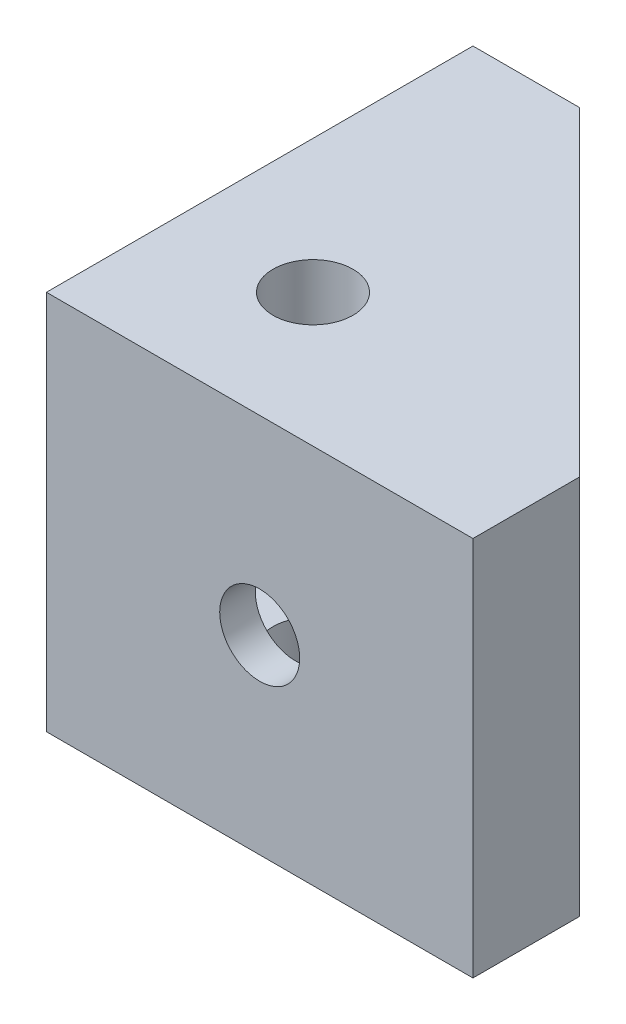
ISO-10303-21;
HEADER;
FILE_DESCRIPTION(('STEP AP214'),'2;1');
FILE_NAME('part.step','',(''),(''),'','','');
FILE_SCHEMA(('AUTOMOTIVE_DESIGN { 1 0 10303 214 1 1 1 1 }'));
ENDSEC;
DATA;
#1=APPLICATION_CONTEXT('core data for automotive mechanical design processes');
#2=APPLICATION_PROTOCOL_DEFINITION('international standard','automotive_design',2000,#1);
#3=PRODUCT_CONTEXT('',#1,'mechanical');
#4=PRODUCT('Part','Part','',(#3));
#5=PRODUCT_RELATED_PRODUCT_CATEGORY('part','',(#4));
#6=PRODUCT_DEFINITION_FORMATION('','',#4);
#7=PRODUCT_DEFINITION_CONTEXT('part definition',#1,'design');
#8=PRODUCT_DEFINITION('design','',#6,#7);
#9=PRODUCT_DEFINITION_SHAPE('','',#8);
#10=(LENGTH_UNIT() NAMED_UNIT(*) SI_UNIT(.MILLI.,.METRE.));
#11=(NAMED_UNIT(*) PLANE_ANGLE_UNIT() SI_UNIT($,.RADIAN.));
#12=(NAMED_UNIT(*) SI_UNIT($,.STERADIAN.) SOLID_ANGLE_UNIT());
#13=UNCERTAINTY_MEASURE_WITH_UNIT(LENGTH_MEASURE(1.E-05),#10,'distance_accuracy_value','');
#14=(GEOMETRIC_REPRESENTATION_CONTEXT(3) GLOBAL_UNCERTAINTY_ASSIGNED_CONTEXT((#13)) GLOBAL_UNIT_ASSIGNED_CONTEXT((#10,
#11,#12)) REPRESENTATION_CONTEXT('',''));
#15=CARTESIAN_POINT('',(0.,0.,0.));
#16=DIRECTION('',(0.,0.,1.));
#17=DIRECTION('',(1.,0.,0.));
#18=AXIS2_PLACEMENT_3D('',#15,#16,#17);
#19=CARTESIAN_POINT('',(19.05,17.,-38.1));
#20=DIRECTION('',(0.,0.,1.));
#21=DIRECTION('',(1.,0.,0.));
#22=AXIS2_PLACEMENT_3D('',#19,#20,#21);
#23=CYLINDRICAL_SURFACE('',#22,3.571875);
#24=CARTESIAN_POINT('',(19.05,17.,-3.17500000000003));
#25=DIRECTION('',(0.,0.,1.));
#26=DIRECTION('',(1.,0.,0.));
#27=AXIS2_PLACEMENT_3D('',#24,#25,#26);
#28=CIRCLE('',#27,3.571875);
#29=CARTESIAN_POINT('',(22.621875,17.,-3.17500000000003));
#30=VERTEX_POINT('',#29);
#31=EDGE_CURVE('E140',#30,#30,#28,.F.);
#32=ORIENTED_EDGE('',*,*,#31,.T.);
#33=EDGE_LOOP('',(#32));
#34=FACE_BOUND('',#33,.T.);
#35=CARTESIAN_POINT('',(19.05,17.,0.));
#36=DIRECTION('',(0.,0.,-1.));
#37=DIRECTION('',(-1.,0.,0.));
#38=AXIS2_PLACEMENT_3D('',#35,#36,#37);
#39=CIRCLE('',#38,3.571875);
#40=CARTESIAN_POINT('',(15.478125,17.,0.));
#41=VERTEX_POINT('',#40);
#42=EDGE_CURVE('E128',#41,#41,#39,.T.);
#43=ORIENTED_EDGE('',*,*,#42,.F.);
#44=EDGE_LOOP('',(#43));
#45=FACE_BOUND('',#44,.T.);
#46=ADVANCED_FACE('F35',(#34,#45),#23,.F.);
#47=CARTESIAN_POINT('',(0.,34.,0.));
#48=DIRECTION('',(1.,0.,0.));
#49=DIRECTION('',(0.,0.,-1.));
#50=AXIS2_PLACEMENT_3D('',#47,#48,#49);
#51=PLANE('',#50);
#52=CARTESIAN_POINT('',(0.,17.,-19.05));
#53=DIRECTION('',(-1.,0.,0.));
#54=DIRECTION('',(0.,0.,1.));
#55=AXIS2_PLACEMENT_3D('',#52,#53,#54);
#56=CIRCLE('',#55,3.571875);
#57=CARTESIAN_POINT('',(0.,17.,-15.478125));
#58=VERTEX_POINT('',#57);
#59=EDGE_CURVE('E143',#58,#58,#56,.T.);
#60=ORIENTED_EDGE('',*,*,#59,.F.);
#61=EDGE_LOOP('',(#60));
#62=FACE_BOUND('',#61,.T.);
#63=DIRECTION('',(0.,0.,1.));
#64=VECTOR('',#63,1.);
#65=CARTESIAN_POINT('',(0.,0.,0.));
#66=LINE('',#65,#64);
#67=CARTESIAN_POINT('',(0.,0.,-38.1));
#68=VERTEX_POINT('',#67);
#69=CARTESIAN_POINT('',(0.,0.,0.));
#70=VERTEX_POINT('',#69);
#71=EDGE_CURVE('E124',#68,#70,#66,.T.);
#72=ORIENTED_EDGE('',*,*,#71,.T.);
#73=DIRECTION('',(0.,-1.,0.));
#74=VECTOR('',#73,1.);
#75=CARTESIAN_POINT('',(0.,34.,0.));
#76=LINE('',#75,#74);
#77=CARTESIAN_POINT('',(0.,34.,0.));
#78=VERTEX_POINT('',#77);
#79=EDGE_CURVE('E12',#78,#70,#76,.T.);
#80=ORIENTED_EDGE('',*,*,#79,.F.);
#81=DIRECTION('',(0.,0.,1.));
#82=VECTOR('',#81,1.);
#83=CARTESIAN_POINT('',(0.,34.,0.));
#84=LINE('',#83,#82);
#85=CARTESIAN_POINT('',(0.,34.,-38.1));
#86=VERTEX_POINT('',#85);
#87=EDGE_CURVE('E134',#86,#78,#84,.T.);
#88=ORIENTED_EDGE('',*,*,#87,.F.);
#89=DIRECTION('',(0.,-1.,0.));
#90=VECTOR('',#89,1.);
#91=CARTESIAN_POINT('',(0.,34.,-38.1));
#92=LINE('',#91,#90);
#93=EDGE_CURVE('E120',#86,#68,#92,.T.);
#94=ORIENTED_EDGE('',*,*,#93,.T.);
#95=EDGE_LOOP('',(#72,#80,#88,#94));
#96=FACE_BOUND('',#95,.T.);
#97=ADVANCED_FACE('F37',(#62,#96),#51,.F.);
#98=CARTESIAN_POINT('',(0.,34.,0.));
#99=DIRECTION('',(0.,0.,-1.));
#100=DIRECTION('',(-1.,0.,0.));
#101=AXIS2_PLACEMENT_3D('',#98,#99,#100);
#102=PLANE('',#101);
#103=ORIENTED_EDGE('',*,*,#42,.T.);
#104=EDGE_LOOP('',(#103));
#105=FACE_BOUND('',#104,.T.);
#106=DIRECTION('',(1.,0.,0.));
#107=VECTOR('',#106,1.);
#108=CARTESIAN_POINT('',(0.,0.,0.));
#109=LINE('',#108,#107);
#110=CARTESIAN_POINT('',(38.1,0.,0.));
#111=VERTEX_POINT('',#110);
#112=EDGE_CURVE('E127',#70,#111,#109,.T.);
#113=ORIENTED_EDGE('',*,*,#112,.T.);
#114=DIRECTION('',(0.,-1.,0.));
#115=VECTOR('',#114,1.);
#116=CARTESIAN_POINT('',(38.1,34.,0.));
#117=LINE('',#116,#115);
#118=CARTESIAN_POINT('',(38.1,34.,0.));
#119=VERTEX_POINT('',#118);
#120=EDGE_CURVE('E44',#119,#111,#117,.T.);
#121=ORIENTED_EDGE('',*,*,#120,.F.);
#122=DIRECTION('',(1.,0.,0.));
#123=VECTOR('',#122,1.);
#124=CARTESIAN_POINT('',(0.,34.,0.));
#125=LINE('',#124,#123);
#126=EDGE_CURVE('E93',#78,#119,#125,.T.);
#127=ORIENTED_EDGE('',*,*,#126,.F.);
#128=ORIENTED_EDGE('',*,*,#79,.T.);
#129=EDGE_LOOP('',(#113,#121,#127,#128));
#130=FACE_BOUND('',#129,.T.);
#131=ADVANCED_FACE('F159',(#105,#130),#102,.F.);
#132=CARTESIAN_POINT('',(38.1,34.,-9.525));
#133=DIRECTION('',(-1.,0.,0.));
#134=DIRECTION('',(0.,0.,1.));
#135=AXIS2_PLACEMENT_3D('',#132,#133,#134);
#136=PLANE('',#135);
#137=DIRECTION('',(0.,0.,-1.));
#138=VECTOR('',#137,1.);
#139=CARTESIAN_POINT('',(38.1,0.,-9.525));
#140=LINE('',#139,#138);
#141=CARTESIAN_POINT('',(38.1,0.,-9.525));
#142=VERTEX_POINT('',#141);
#143=EDGE_CURVE('E113',#111,#142,#140,.T.);
#144=ORIENTED_EDGE('',*,*,#143,.T.);
#145=DIRECTION('',(0.,-1.,0.));
#146=VECTOR('',#145,1.);
#147=CARTESIAN_POINT('',(38.1,34.,-9.525));
#148=LINE('',#147,#146);
#149=CARTESIAN_POINT('',(38.1,34.,-9.525));
#150=VERTEX_POINT('',#149);
#151=EDGE_CURVE('E110',#150,#142,#148,.T.);
#152=ORIENTED_EDGE('',*,*,#151,.F.);
#153=DIRECTION('',(0.,0.,-1.));
#154=VECTOR('',#153,1.);
#155=CARTESIAN_POINT('',(38.1,34.,-9.525));
#156=LINE('',#155,#154);
#157=EDGE_CURVE('E100',#119,#150,#156,.T.);
#158=ORIENTED_EDGE('',*,*,#157,.F.);
#159=ORIENTED_EDGE('',*,*,#120,.T.);
#160=EDGE_LOOP('',(#144,#152,#158,#159));
#161=FACE_BOUND('',#160,.T.);
#162=ADVANCED_FACE('F111',(#161),#136,.F.);
#163=CARTESIAN_POINT('',(9.525,34.,-38.1));
#164=DIRECTION('',(-0.707106781186547,0.,0.707106781186547));
#165=DIRECTION('',(0.707106781186548,0.,0.707106781186548));
#166=AXIS2_PLACEMENT_3D('',#163,#164,#165);
#167=PLANE('',#166);
#168=DIRECTION('',(-0.707106781186548,0.,-0.707106781186547));
#169=VECTOR('',#168,1.);
#170=CARTESIAN_POINT('',(11.2087980227005,27.65,-36.4162019772995));
#171=LINE('',#170,#169);
#172=CARTESIAN_POINT('',(36.4162019772995,27.65,-11.2087980227005));
#173=VERTEX_POINT('',#172);
#174=CARTESIAN_POINT('',(11.2087980227005,27.65,-36.4162019772995));
#175=VERTEX_POINT('',#174);
#176=EDGE_CURVE('E204',#173,#175,#171,.T.);
#177=ORIENTED_EDGE('',*,*,#176,.T.);
#178=DIRECTION('',(0.,1.,0.));
#179=VECTOR('',#178,1.);
#180=CARTESIAN_POINT('',(11.2087980227005,-47.0101586658803,-36.4162019772995));
#181=LINE('',#180,#179);
#182=CARTESIAN_POINT('',(11.2087980227005,6.35,-36.4162019772995));
#183=VERTEX_POINT('',#182);
#184=EDGE_CURVE('E141',#183,#175,#181,.T.);
#185=ORIENTED_EDGE('',*,*,#184,.F.);
#186=DIRECTION('',(-0.707106781186548,0.,-0.707106781186547));
#187=VECTOR('',#186,1.);
#188=CARTESIAN_POINT('',(11.2087980227005,6.35,-36.4162019772995));
#189=LINE('',#188,#187);
#190=CARTESIAN_POINT('',(36.4162019772995,6.35,-11.2087980227005));
#191=VERTEX_POINT('',#190);
#192=EDGE_CURVE('E221',#191,#183,#189,.T.);
#193=ORIENTED_EDGE('',*,*,#192,.F.);
#194=DIRECTION('',(0.,1.,0.));
#195=VECTOR('',#194,1.);
#196=CARTESIAN_POINT('',(36.4162019772995,-47.0101586658803,-11.2087980227005));
#197=LINE('',#196,#195);
#198=EDGE_CURVE('E224',#191,#173,#197,.T.);
#199=ORIENTED_EDGE('',*,*,#198,.T.);
#200=EDGE_LOOP('',(#177,#185,#193,#199));
#201=FACE_BOUND('',#200,.T.);
#202=DIRECTION('',(-0.707106781186548,0.,-0.707106781186548));
#203=VECTOR('',#202,1.);
#204=CARTESIAN_POINT('',(9.525,0.,-38.1));
#205=LINE('',#204,#203);
#206=CARTESIAN_POINT('',(9.525,0.,-38.1));
#207=VERTEX_POINT('',#206);
#208=EDGE_CURVE('E131',#142,#207,#205,.T.);
#209=ORIENTED_EDGE('',*,*,#208,.T.);
#210=DIRECTION('',(0.,-1.,0.));
#211=VECTOR('',#210,1.);
#212=CARTESIAN_POINT('',(9.525,34.,-38.1));
#213=LINE('',#212,#211);
#214=CARTESIAN_POINT('',(9.525,34.,-38.1));
#215=VERTEX_POINT('',#214);
#216=EDGE_CURVE('E116',#215,#207,#213,.T.);
#217=ORIENTED_EDGE('',*,*,#216,.F.);
#218=DIRECTION('',(-0.707106781186548,0.,-0.707106781186548));
#219=VECTOR('',#218,1.);
#220=CARTESIAN_POINT('',(9.525,34.,-38.1));
#221=LINE('',#220,#219);
#222=EDGE_CURVE('E104',#150,#215,#221,.T.);
#223=ORIENTED_EDGE('',*,*,#222,.F.);
#224=ORIENTED_EDGE('',*,*,#151,.T.);
#225=EDGE_LOOP('',(#209,#217,#223,#224));
#226=FACE_BOUND('',#225,.T.);
#227=ADVANCED_FACE('F118',(#201,#226),#167,.F.);
#228=CARTESIAN_POINT('',(0.,34.,-38.1));
#229=DIRECTION('',(0.,0.,1.));
#230=DIRECTION('',(1.,0.,0.));
#231=AXIS2_PLACEMENT_3D('',#228,#229,#230);
#232=PLANE('',#231);
#233=DIRECTION('',(-1.,0.,0.));
#234=VECTOR('',#233,1.);
#235=CARTESIAN_POINT('',(0.,0.,-38.1));
#236=LINE('',#235,#234);
#237=EDGE_CURVE('E85',#207,#68,#236,.T.);
#238=ORIENTED_EDGE('',*,*,#237,.T.);
#239=ORIENTED_EDGE('',*,*,#93,.F.);
#240=DIRECTION('',(-1.,0.,0.));
#241=VECTOR('',#240,1.);
#242=CARTESIAN_POINT('',(0.,34.,-38.1));
#243=LINE('',#242,#241);
#244=EDGE_CURVE('E61',#215,#86,#243,.T.);
#245=ORIENTED_EDGE('',*,*,#244,.F.);
#246=ORIENTED_EDGE('',*,*,#216,.T.);
#247=EDGE_LOOP('',(#238,#239,#245,#246));
#248=FACE_BOUND('',#247,.T.);
#249=ADVANCED_FACE('F162',(#248),#232,.F.);
#250=CARTESIAN_POINT('',(0.,34.,0.));
#251=DIRECTION('',(0.,-1.,0.));
#252=DIRECTION('',(0.,0.,-1.));
#253=AXIS2_PLACEMENT_3D('',#250,#251,#252);
#254=PLANE('',#253);
#255=CARTESIAN_POINT('',(11.90625,34.,-11.90625));
#256=DIRECTION('',(0.,-1.,0.));
#257=DIRECTION('',(0.,0.,-1.));
#258=AXIS2_PLACEMENT_3D('',#255,#256,#257);
#259=CIRCLE('',#258,3.571875);
#260=CARTESIAN_POINT('',(11.90625,34.,-15.478125));
#261=VERTEX_POINT('',#260);
#262=EDGE_CURVE('E201',#261,#261,#259,.T.);
#263=ORIENTED_EDGE('',*,*,#262,.T.);
#264=EDGE_LOOP('',(#263));
#265=FACE_BOUND('',#264,.T.);
#266=ORIENTED_EDGE('',*,*,#87,.T.);
#267=ORIENTED_EDGE('',*,*,#126,.T.);
#268=ORIENTED_EDGE('',*,*,#157,.T.);
#269=ORIENTED_EDGE('',*,*,#222,.T.);
#270=ORIENTED_EDGE('',*,*,#244,.T.);
#271=EDGE_LOOP('',(#266,#267,#268,#269,#270));
#272=FACE_BOUND('',#271,.T.);
#273=ADVANCED_FACE('F102',(#265,#272),#254,.F.);
#274=CARTESIAN_POINT('',(0.,0.,0.));
#275=DIRECTION('',(0.,-1.,0.));
#276=DIRECTION('',(0.,0.,-1.));
#277=AXIS2_PLACEMENT_3D('',#274,#275,#276);
#278=PLANE('',#277);
#279=CARTESIAN_POINT('',(11.90625,0.,-11.90625));
#280=DIRECTION('',(0.,1.,0.));
#281=DIRECTION('',(0.,0.,1.));
#282=AXIS2_PLACEMENT_3D('',#279,#280,#281);
#283=CIRCLE('',#282,3.571875);
#284=CARTESIAN_POINT('',(11.90625,0.,-8.334375));
#285=VERTEX_POINT('',#284);
#286=EDGE_CURVE('E193',#285,#285,#283,.T.);
#287=ORIENTED_EDGE('',*,*,#286,.T.);
#288=EDGE_LOOP('',(#287));
#289=FACE_BOUND('',#288,.T.);
#290=ORIENTED_EDGE('',*,*,#71,.F.);
#291=ORIENTED_EDGE('',*,*,#237,.F.);
#292=ORIENTED_EDGE('',*,*,#208,.F.);
#293=ORIENTED_EDGE('',*,*,#143,.F.);
#294=ORIENTED_EDGE('',*,*,#112,.F.);
#295=EDGE_LOOP('',(#290,#291,#292,#293,#294));
#296=FACE_BOUND('',#295,.T.);
#297=ADVANCED_FACE('F161',(#289,#296),#278,.T.);
#298=CARTESIAN_POINT('',(34.,17.,-19.05));
#299=DIRECTION('',(-1.,0.,0.));
#300=DIRECTION('',(0.,0.,1.));
#301=AXIS2_PLACEMENT_3D('',#298,#299,#300);
#302=CYLINDRICAL_SURFACE('',#301,3.571875);
#303=CARTESIAN_POINT('',(3.175,17.,-19.05));
#304=DIRECTION('',(-1.,0.,0.));
#305=DIRECTION('',(0.,0.,1.));
#306=AXIS2_PLACEMENT_3D('',#303,#304,#305);
#307=CIRCLE('',#306,3.571875);
#308=CARTESIAN_POINT('',(3.17500000000001,17.,-15.478125));
#309=VERTEX_POINT('',#308);
#310=EDGE_CURVE('E138',#309,#309,#307,.F.);
#311=ORIENTED_EDGE('',*,*,#310,.T.);
#312=EDGE_LOOP('',(#311));
#313=FACE_BOUND('',#312,.T.);
#314=ORIENTED_EDGE('',*,*,#59,.T.);
#315=EDGE_LOOP('',(#314));
#316=FACE_BOUND('',#315,.T.);
#317=ADVANCED_FACE('F182',(#313,#316),#302,.F.);
#318=CARTESIAN_POINT('',(3.17500000000001,-47.0101586658803,-3.17500000000001));
#319=DIRECTION('',(0.,0.,1.));
#320=DIRECTION('',(1.,0.,0.));
#321=AXIS2_PLACEMENT_3D('',#318,#319,#320);
#322=PLANE('',#321);
#323=DIRECTION('',(0.,1.,0.));
#324=VECTOR('',#323,1.);
#325=CARTESIAN_POINT('',(3.17500000000001,-47.0101586658803,-3.17500000000001));
#326=LINE('',#325,#324);
#327=CARTESIAN_POINT('',(3.17500000000001,6.35,-3.17500000000001));
#328=VERTEX_POINT('',#327);
#329=CARTESIAN_POINT('',(3.17500000000001,27.65,-3.17500000000001));
#330=VERTEX_POINT('',#329);
#331=EDGE_CURVE('E232',#328,#330,#326,.T.);
#332=ORIENTED_EDGE('',*,*,#331,.T.);
#333=DIRECTION('',(1.,0.,0.));
#334=VECTOR('',#333,1.);
#335=CARTESIAN_POINT('',(3.17500000000001,27.65,-3.17500000000001));
#336=LINE('',#335,#334);
#337=CARTESIAN_POINT('',(28.3824039545991,27.65,-3.17500000000001));
#338=VERTEX_POINT('',#337);
#339=EDGE_CURVE('E207',#330,#338,#336,.T.);
#340=ORIENTED_EDGE('',*,*,#339,.T.);
#341=DIRECTION('',(0.,1.,0.));
#342=VECTOR('',#341,1.);
#343=CARTESIAN_POINT('',(28.3824039545991,-47.0101586658803,-3.17500000000001));
#344=LINE('',#343,#342);
#345=CARTESIAN_POINT('',(28.3824039545991,6.35,-3.17500000000001));
#346=VERTEX_POINT('',#345);
#347=EDGE_CURVE('E228',#346,#338,#344,.T.);
#348=ORIENTED_EDGE('',*,*,#347,.F.);
#349=DIRECTION('',(1.,0.,0.));
#350=VECTOR('',#349,1.);
#351=CARTESIAN_POINT('',(3.17500000000001,6.35,-3.17500000000001));
#352=LINE('',#351,#350);
#353=EDGE_CURVE('E229',#328,#346,#352,.T.);
#354=ORIENTED_EDGE('',*,*,#353,.F.);
#355=EDGE_LOOP('',(#332,#340,#348,#354));
#356=FACE_BOUND('',#355,.T.);
#357=ORIENTED_EDGE('',*,*,#31,.F.);
#358=EDGE_LOOP('',(#357));
#359=FACE_BOUND('',#358,.T.);
#360=ADVANCED_FACE('F189',(#356,#359),#322,.F.);
#361=CARTESIAN_POINT('',(3.175,-47.0101586658803,-28.3824039545991));
#362=DIRECTION('',(-1.,0.,0.));
#363=DIRECTION('',(0.,0.,1.));
#364=AXIS2_PLACEMENT_3D('',#361,#362,#363);
#365=PLANE('',#364);
#366=DIRECTION('',(0.,1.,0.));
#367=VECTOR('',#366,1.);
#368=CARTESIAN_POINT('',(3.175,-47.0101586658803,-28.3824039545991));
#369=LINE('',#368,#367);
#370=CARTESIAN_POINT('',(3.175,6.34999999999999,-28.3824039545991));
#371=VERTEX_POINT('',#370);
#372=CARTESIAN_POINT('',(3.175,27.65,-28.3824039545991));
#373=VERTEX_POINT('',#372);
#374=EDGE_CURVE('E220',#371,#373,#369,.T.);
#375=ORIENTED_EDGE('',*,*,#374,.T.);
#376=DIRECTION('',(0.,0.,1.));
#377=VECTOR('',#376,1.);
#378=CARTESIAN_POINT('',(3.175,27.65,-28.3824039545991));
#379=LINE('',#378,#377);
#380=EDGE_CURVE('E210',#373,#330,#379,.T.);
#381=ORIENTED_EDGE('',*,*,#380,.T.);
#382=ORIENTED_EDGE('',*,*,#331,.F.);
#383=DIRECTION('',(0.,0.,1.));
#384=VECTOR('',#383,1.);
#385=CARTESIAN_POINT('',(3.175,6.35,-28.3824039545991));
#386=LINE('',#385,#384);
#387=EDGE_CURVE('E233',#371,#328,#386,.T.);
#388=ORIENTED_EDGE('',*,*,#387,.F.);
#389=EDGE_LOOP('',(#375,#381,#382,#388));
#390=FACE_BOUND('',#389,.T.);
#391=ORIENTED_EDGE('',*,*,#310,.F.);
#392=EDGE_LOOP('',(#391));
#393=FACE_BOUND('',#392,.T.);
#394=ADVANCED_FACE('F246',(#390,#393),#365,.F.);
#395=CARTESIAN_POINT('',(0.,6.35,0.));
#396=DIRECTION('',(0.,-1.,0.));
#397=DIRECTION('',(0.,0.,-1.));
#398=AXIS2_PLACEMENT_3D('',#395,#396,#397);
#399=PLANE('',#398);
#400=CARTESIAN_POINT('',(11.90625,6.35,-11.90625));
#401=DIRECTION('',(0.,-1.,0.));
#402=DIRECTION('',(0.,0.,-1.));
#403=AXIS2_PLACEMENT_3D('',#400,#401,#402);
#404=CIRCLE('',#403,3.571875);
#405=CARTESIAN_POINT('',(11.90625,6.35,-15.478125));
#406=VERTEX_POINT('',#405);
#407=EDGE_CURVE('E197',#406,#406,#404,.T.);
#408=ORIENTED_EDGE('',*,*,#407,.T.);
#409=EDGE_LOOP('',(#408));
#410=FACE_BOUND('',#409,.T.);
#411=ORIENTED_EDGE('',*,*,#192,.T.);
#412=DIRECTION('',(-0.707106781186548,0.,0.707106781186548));
#413=VECTOR('',#412,1.);
#414=CARTESIAN_POINT('',(3.175,6.35,-28.3824039545991));
#415=LINE('',#414,#413);
#416=EDGE_CURVE('E206',#183,#371,#415,.T.);
#417=ORIENTED_EDGE('',*,*,#416,.T.);
#418=ORIENTED_EDGE('',*,*,#387,.T.);
#419=ORIENTED_EDGE('',*,*,#353,.T.);
#420=DIRECTION('',(0.707106781186548,0.,-0.707106781186548));
#421=VECTOR('',#420,1.);
#422=CARTESIAN_POINT('',(36.4162019772995,6.35,-11.2087980227005));
#423=LINE('',#422,#421);
#424=EDGE_CURVE('E225',#346,#191,#423,.T.);
#425=ORIENTED_EDGE('',*,*,#424,.T.);
#426=EDGE_LOOP('',(#411,#417,#418,#419,#425));
#427=FACE_BOUND('',#426,.T.);
#428=ADVANCED_FACE('F279',(#410,#427),#399,.F.);
#429=CARTESIAN_POINT('',(0.,27.65,0.));
#430=DIRECTION('',(0.,-1.,0.));
#431=DIRECTION('',(0.,0.,-1.));
#432=AXIS2_PLACEMENT_3D('',#429,#430,#431);
#433=PLANE('',#432);
#434=CARTESIAN_POINT('',(11.90625,27.65,-11.90625));
#435=DIRECTION('',(0.,-1.,0.));
#436=DIRECTION('',(0.,0.,-1.));
#437=AXIS2_PLACEMENT_3D('',#434,#435,#436);
#438=CIRCLE('',#437,3.571875);
#439=CARTESIAN_POINT('',(11.90625,27.65,-15.478125));
#440=VERTEX_POINT('',#439);
#441=EDGE_CURVE('E39',#440,#440,#438,.T.);
#442=ORIENTED_EDGE('',*,*,#441,.F.);
#443=EDGE_LOOP('',(#442));
#444=FACE_BOUND('',#443,.T.);
#445=ORIENTED_EDGE('',*,*,#176,.F.);
#446=DIRECTION('',(0.707106781186548,0.,-0.707106781186548));
#447=VECTOR('',#446,1.);
#448=CARTESIAN_POINT('',(36.4162019772995,27.65,-11.2087980227005));
#449=LINE('',#448,#447);
#450=EDGE_CURVE('E52',#338,#173,#449,.T.);
#451=ORIENTED_EDGE('',*,*,#450,.F.);
#452=ORIENTED_EDGE('',*,*,#339,.F.);
#453=ORIENTED_EDGE('',*,*,#380,.F.);
#454=DIRECTION('',(-0.707106781186548,0.,0.707106781186548));
#455=VECTOR('',#454,1.);
#456=CARTESIAN_POINT('',(3.175,27.65,-28.3824039545991));
#457=LINE('',#456,#455);
#458=EDGE_CURVE('E213',#175,#373,#457,.T.);
#459=ORIENTED_EDGE('',*,*,#458,.F.);
#460=EDGE_LOOP('',(#445,#451,#452,#453,#459));
#461=FACE_BOUND('',#460,.T.);
#462=ADVANCED_FACE('F257',(#444,#461),#433,.T.);
#463=CARTESIAN_POINT('',(3.175,-47.0101586658803,-28.3824039545991));
#464=DIRECTION('',(-0.707106781186547,0.,-0.707106781186547));
#465=DIRECTION('',(-0.707106781186548,0.,0.707106781186548));
#466=AXIS2_PLACEMENT_3D('',#463,#464,#465);
#467=PLANE('',#466);
#468=ORIENTED_EDGE('',*,*,#184,.T.);
#469=ORIENTED_EDGE('',*,*,#458,.T.);
#470=ORIENTED_EDGE('',*,*,#374,.F.);
#471=ORIENTED_EDGE('',*,*,#416,.F.);
#472=EDGE_LOOP('',(#468,#469,#470,#471));
#473=FACE_BOUND('',#472,.T.);
#474=ADVANCED_FACE('F259',(#473),#467,.F.);
#475=CARTESIAN_POINT('',(36.4162019772995,-47.0101586658803,-11.2087980227005));
#476=DIRECTION('',(0.707106781186547,0.,0.707106781186547));
#477=DIRECTION('',(0.707106781186548,0.,-0.707106781186548));
#478=AXIS2_PLACEMENT_3D('',#475,#476,#477);
#479=PLANE('',#478);
#480=ORIENTED_EDGE('',*,*,#347,.T.);
#481=ORIENTED_EDGE('',*,*,#450,.T.);
#482=ORIENTED_EDGE('',*,*,#198,.F.);
#483=ORIENTED_EDGE('',*,*,#424,.F.);
#484=EDGE_LOOP('',(#480,#481,#482,#483));
#485=FACE_BOUND('',#484,.T.);
#486=ADVANCED_FACE('F275',(#485),#479,.F.);
#487=CARTESIAN_POINT('',(11.90625,0.,-11.90625));
#488=DIRECTION('',(0.,1.,0.));
#489=DIRECTION('',(0.,0.,1.));
#490=AXIS2_PLACEMENT_3D('',#487,#488,#489);
#491=CYLINDRICAL_SURFACE('',#490,3.571875);
#492=ORIENTED_EDGE('',*,*,#441,.T.);
#493=EDGE_LOOP('',(#492));
#494=FACE_BOUND('',#493,.T.);
#495=ORIENTED_EDGE('',*,*,#262,.F.);
#496=EDGE_LOOP('',(#495));
#497=FACE_BOUND('',#496,.T.);
#498=ADVANCED_FACE('F295',(#494,#497),#491,.F.);
#499=ORIENTED_EDGE('',*,*,#286,.F.);
#500=EDGE_LOOP('',(#499));
#501=FACE_BOUND('',#500,.T.);
#502=ORIENTED_EDGE('',*,*,#407,.F.);
#503=EDGE_LOOP('',(#502));
#504=FACE_BOUND('',#503,.T.);
#505=ADVANCED_FACE('F298',(#501,#504),#491,.F.);
#506=CLOSED_SHELL('',(#46,#97,#131,#162,#227,#249,#273,#297,#317,#360,#394,#428,#462,#474,#486,
#498,#505));
#507=MANIFOLD_SOLID_BREP('B2',#506);
#508=ADVANCED_BREP_SHAPE_REPRESENTATION('',(#18,#507),#14);
#509=SHAPE_DEFINITION_REPRESENTATION(#9,#508);
ENDSEC;
END-ISO-10303-21;
